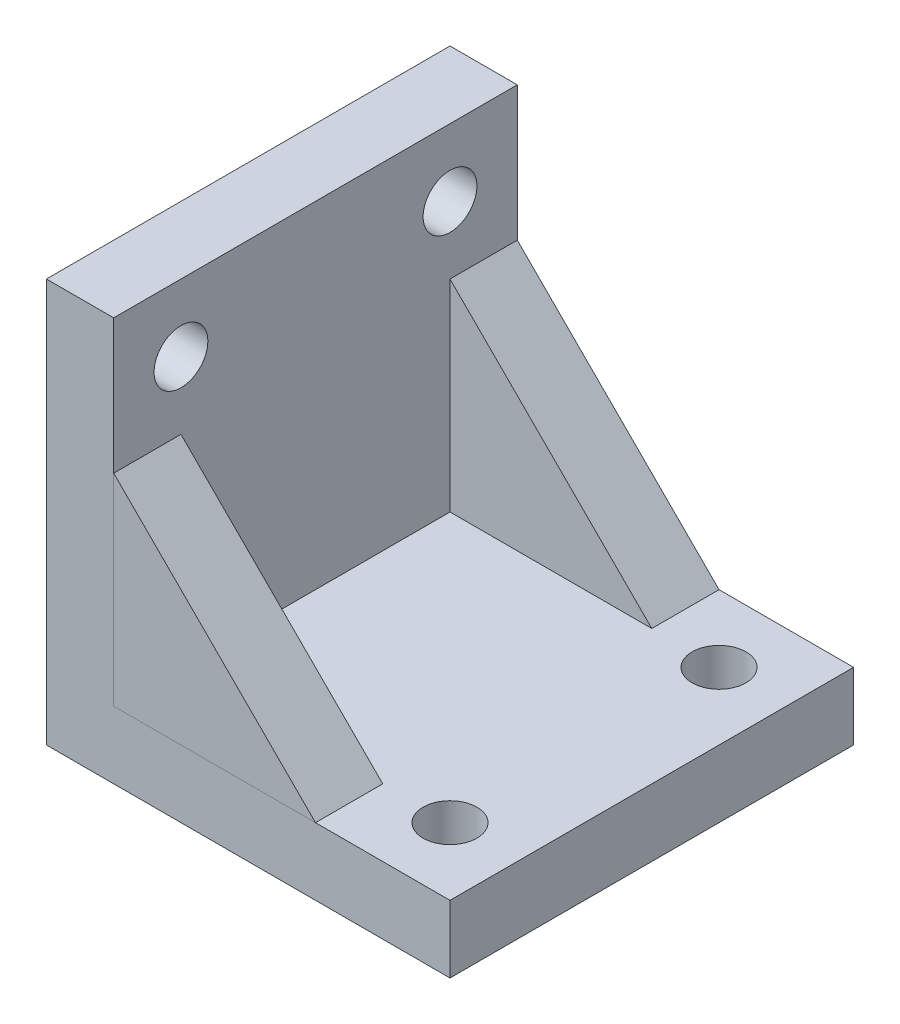
ISO-10303-21;
HEADER;
FILE_DESCRIPTION(('STEP AP214'),'2;1');
FILE_NAME('part.step','',(''),(''),'','','');
FILE_SCHEMA(('AUTOMOTIVE_DESIGN { 1 0 10303 214 1 1 1 1 }'));
ENDSEC;
DATA;
#1=APPLICATION_CONTEXT('core data for automotive mechanical design processes');
#2=APPLICATION_PROTOCOL_DEFINITION('international standard','automotive_design',2000,#1);
#3=PRODUCT_CONTEXT('',#1,'mechanical');
#4=PRODUCT('Part','Part','',(#3));
#5=PRODUCT_RELATED_PRODUCT_CATEGORY('part','',(#4));
#6=PRODUCT_DEFINITION_FORMATION('','',#4);
#7=PRODUCT_DEFINITION_CONTEXT('part definition',#1,'design');
#8=PRODUCT_DEFINITION('design','',#6,#7);
#9=PRODUCT_DEFINITION_SHAPE('','',#8);
#10=(LENGTH_UNIT() NAMED_UNIT(*) SI_UNIT(.MILLI.,.METRE.));
#11=(NAMED_UNIT(*) PLANE_ANGLE_UNIT() SI_UNIT($,.RADIAN.));
#12=(NAMED_UNIT(*) SI_UNIT($,.STERADIAN.) SOLID_ANGLE_UNIT());
#13=UNCERTAINTY_MEASURE_WITH_UNIT(LENGTH_MEASURE(1.E-05),#10,'distance_accuracy_value','');
#14=(GEOMETRIC_REPRESENTATION_CONTEXT(3) GLOBAL_UNCERTAINTY_ASSIGNED_CONTEXT((#13)) GLOBAL_UNIT_ASSIGNED_CONTEXT((#10,
#11,#12)) REPRESENTATION_CONTEXT('',''));
#15=CARTESIAN_POINT('',(0.,0.,0.));
#16=DIRECTION('',(0.,0.,1.));
#17=DIRECTION('',(1.,0.,0.));
#18=AXIS2_PLACEMENT_3D('',#15,#16,#17);
#19=CARTESIAN_POINT('',(5.00000000000001,5.,10.));
#20=DIRECTION('',(0.,-1.,0.));
#21=DIRECTION('',(0.,0.,-1.));
#22=AXIS2_PLACEMENT_3D('',#19,#20,#21);
#23=PLANE('',#22);
#24=DIRECTION('',(1.,0.,0.));
#25=VECTOR('',#24,1.);
#26=CARTESIAN_POINT('',(5.00000000000001,5.,15.));
#27=LINE('',#26,#25);
#28=CARTESIAN_POINT('',(-9.99999999999999,5.,15.));
#29=VERTEX_POINT('',#28);
#30=CARTESIAN_POINT('',(5.00000000000001,5.,15.));
#31=VERTEX_POINT('',#30);
#32=EDGE_CURVE('E96',#29,#31,#27,.T.);
#33=ORIENTED_EDGE('',*,*,#32,.F.);
#34=DIRECTION('',(0.,0.,1.));
#35=VECTOR('',#34,1.);
#36=CARTESIAN_POINT('',(-9.99999999999999,5.,10.));
#37=LINE('',#36,#35);
#38=CARTESIAN_POINT('',(-9.99999999999999,5.,10.));
#39=VERTEX_POINT('',#38);
#40=EDGE_CURVE('E12',#39,#29,#37,.T.);
#41=ORIENTED_EDGE('',*,*,#40,.F.);
#42=DIRECTION('',(1.,0.,0.));
#43=VECTOR('',#42,1.);
#44=CARTESIAN_POINT('',(5.00000000000001,5.,10.));
#45=LINE('',#44,#43);
#46=CARTESIAN_POINT('',(5.00000000000001,5.,10.));
#47=VERTEX_POINT('',#46);
#48=EDGE_CURVE('E88',#39,#47,#45,.T.);
#49=ORIENTED_EDGE('',*,*,#48,.T.);
#50=DIRECTION('',(0.,0.,1.));
#51=VECTOR('',#50,1.);
#52=CARTESIAN_POINT('',(5.00000000000001,5.,10.));
#53=LINE('',#52,#51);
#54=EDGE_CURVE('E47',#47,#31,#53,.T.);
#55=ORIENTED_EDGE('',*,*,#54,.T.);
#56=EDGE_LOOP('',(#33,#41,#49,#55));
#57=FACE_BOUND('',#56,.T.);
#58=ADVANCED_FACE('F44',(#57),#23,.T.);
#59=CARTESIAN_POINT('',(-9.99999999999999,5.,10.));
#60=DIRECTION('',(-1.,0.,0.));
#61=DIRECTION('',(0.,-1.,0.));
#62=AXIS2_PLACEMENT_3D('',#59,#60,#61);
#63=PLANE('',#62);
#64=DIRECTION('',(0.,-1.,0.));
#65=VECTOR('',#64,1.);
#66=CARTESIAN_POINT('',(-9.99999999999999,5.,15.));
#67=LINE('',#66,#65);
#68=CARTESIAN_POINT('',(-9.99999999999999,20.,15.));
#69=VERTEX_POINT('',#68);
#70=EDGE_CURVE('E90',#69,#29,#67,.T.);
#71=ORIENTED_EDGE('',*,*,#70,.F.);
#72=DIRECTION('',(0.,0.,1.));
#73=VECTOR('',#72,1.);
#74=CARTESIAN_POINT('',(-9.99999999999999,20.,10.));
#75=LINE('',#74,#73);
#76=CARTESIAN_POINT('',(-9.99999999999999,20.,10.));
#77=VERTEX_POINT('',#76);
#78=EDGE_CURVE('E53',#77,#69,#75,.T.);
#79=ORIENTED_EDGE('',*,*,#78,.F.);
#80=DIRECTION('',(0.,-1.,0.));
#81=VECTOR('',#80,1.);
#82=CARTESIAN_POINT('',(-9.99999999999999,5.,10.));
#83=LINE('',#82,#81);
#84=EDGE_CURVE('E85',#77,#39,#83,.T.);
#85=ORIENTED_EDGE('',*,*,#84,.T.);
#86=ORIENTED_EDGE('',*,*,#40,.T.);
#87=EDGE_LOOP('',(#71,#79,#85,#86));
#88=FACE_BOUND('',#87,.T.);
#89=ADVANCED_FACE('F100',(#88),#63,.T.);
#90=CARTESIAN_POINT('',(-9.99999999999999,20.,10.));
#91=DIRECTION('',(0.707106781186548,0.707106781186548,0.));
#92=DIRECTION('',(-0.707106781186548,0.707106781186548,0.));
#93=AXIS2_PLACEMENT_3D('',#90,#91,#92);
#94=PLANE('',#93);
#95=DIRECTION('',(-0.707106781186547,0.707106781186547,0.));
#96=VECTOR('',#95,1.);
#97=CARTESIAN_POINT('',(-9.99999999999999,20.,15.));
#98=LINE('',#97,#96);
#99=EDGE_CURVE('E83',#31,#69,#98,.T.);
#100=ORIENTED_EDGE('',*,*,#99,.F.);
#101=ORIENTED_EDGE('',*,*,#54,.F.);
#102=DIRECTION('',(-0.707106781186547,0.707106781186547,0.));
#103=VECTOR('',#102,1.);
#104=CARTESIAN_POINT('',(-9.99999999999999,20.,10.));
#105=LINE('',#104,#103);
#106=EDGE_CURVE('E81',#47,#77,#105,.T.);
#107=ORIENTED_EDGE('',*,*,#106,.T.);
#108=ORIENTED_EDGE('',*,*,#78,.T.);
#109=EDGE_LOOP('',(#100,#101,#107,#108));
#110=FACE_BOUND('',#109,.T.);
#111=ADVANCED_FACE('F80',(#110),#94,.T.);
#112=CARTESIAN_POINT('',(0.,0.,10.));
#113=DIRECTION('',(0.,0.,-1.));
#114=DIRECTION('',(-1.,0.,0.));
#115=AXIS2_PLACEMENT_3D('',#112,#113,#114);
#116=PLANE('',#115);
#117=ORIENTED_EDGE('',*,*,#48,.F.);
#118=ORIENTED_EDGE('',*,*,#84,.F.);
#119=ORIENTED_EDGE('',*,*,#106,.F.);
#120=EDGE_LOOP('',(#117,#118,#119));
#121=FACE_BOUND('',#120,.T.);
#122=ADVANCED_FACE('F87',(#121),#116,.T.);
#123=CARTESIAN_POINT('',(0.,0.,15.));
#124=DIRECTION('',(0.,0.,-1.));
#125=DIRECTION('',(-1.,0.,0.));
#126=AXIS2_PLACEMENT_3D('',#123,#124,#125);
#127=PLANE('',#126);
#128=ORIENTED_EDGE('',*,*,#32,.T.);
#129=ORIENTED_EDGE('',*,*,#99,.T.);
#130=ORIENTED_EDGE('',*,*,#70,.T.);
#131=EDGE_LOOP('',(#128,#129,#130));
#132=FACE_BOUND('',#131,.T.);
#133=ADVANCED_FACE('F99',(#132),#127,.F.);
#134=CLOSED_SHELL('',(#58,#89,#111,#122,#133));
#135=MANIFOLD_SOLID_BREP('B2',#134);
#136=CARTESIAN_POINT('',(0.,5.,0.));
#137=DIRECTION('',(0.,-1.,0.));
#138=DIRECTION('',(0.,0.,-1.));
#139=AXIS2_PLACEMENT_3D('',#136,#137,#138);
#140=PLANE('',#139);
#141=CARTESIAN_POINT('',(10.,5.,10.));
#142=DIRECTION('',(0.,1.,0.));
#143=DIRECTION('',(0.,0.,1.));
#144=AXIS2_PLACEMENT_3D('',#141,#142,#143);
#145=CIRCLE('',#144,2.);
#146=CARTESIAN_POINT('',(10.,5.,12.));
#147=VERTEX_POINT('',#146);
#148=EDGE_CURVE('E308',#147,#147,#145,.T.);
#149=ORIENTED_EDGE('',*,*,#148,.F.);
#150=EDGE_LOOP('',(#149));
#151=FACE_BOUND('',#150,.T.);
#152=CARTESIAN_POINT('',(10.,5.,-10.));
#153=DIRECTION('',(0.,1.,0.));
#154=DIRECTION('',(0.,0.,1.));
#155=AXIS2_PLACEMENT_3D('',#152,#153,#154);
#156=CIRCLE('',#155,2.);
#157=CARTESIAN_POINT('',(10.,5.,-8.));
#158=VERTEX_POINT('',#157);
#159=EDGE_CURVE('E302',#158,#158,#156,.T.);
#160=ORIENTED_EDGE('',*,*,#159,.F.);
#161=EDGE_LOOP('',(#160));
#162=FACE_BOUND('',#161,.T.);
#163=DIRECTION('',(0.,0.,-1.));
#164=VECTOR('',#163,1.);
#165=CARTESIAN_POINT('',(5.00000000000001,5.,-10.));
#166=LINE('',#165,#164);
#167=CARTESIAN_POINT('',(5.00000000000001,5.,-10.));
#168=VERTEX_POINT('',#167);
#169=CARTESIAN_POINT('',(5.00000000000001,5.,-15.));
#170=VERTEX_POINT('',#169);
#171=EDGE_CURVE('E241',#168,#170,#166,.T.);
#172=ORIENTED_EDGE('',*,*,#171,.F.);
#173=DIRECTION('',(1.,0.,0.));
#174=VECTOR('',#173,1.);
#175=CARTESIAN_POINT('',(5.00000000000001,5.,-10.));
#176=LINE('',#175,#174);
#177=CARTESIAN_POINT('',(-9.99999999999999,5.,-10.));
#178=VERTEX_POINT('',#177);
#179=EDGE_CURVE('E256',#178,#168,#176,.T.);
#180=ORIENTED_EDGE('',*,*,#179,.F.);
#181=DIRECTION('',(0.,0.,-1.));
#182=VECTOR('',#181,1.);
#183=CARTESIAN_POINT('',(-9.99999999999999,5.,-15.));
#184=LINE('',#183,#182);
#185=CARTESIAN_POINT('',(-9.99999999999999,5.,15.));
#186=VERTEX_POINT('',#185);
#187=EDGE_CURVE('E156',#186,#178,#184,.T.);
#188=ORIENTED_EDGE('',*,*,#187,.F.);
#189=DIRECTION('',(1.,0.,0.));
#190=VECTOR('',#189,1.);
#191=CARTESIAN_POINT('',(-15.,5.,15.));
#192=LINE('',#191,#190);
#193=CARTESIAN_POINT('',(15.,5.,15.));
#194=VERTEX_POINT('',#193);
#195=EDGE_CURVE('E161',#186,#194,#192,.T.);
#196=ORIENTED_EDGE('',*,*,#195,.T.);
#197=DIRECTION('',(0.,0.,-1.));
#198=VECTOR('',#197,1.);
#199=CARTESIAN_POINT('',(15.,5.,15.));
#200=LINE('',#199,#198);
#201=CARTESIAN_POINT('',(15.,5.,-15.));
#202=VERTEX_POINT('',#201);
#203=EDGE_CURVE('E192',#194,#202,#200,.T.);
#204=ORIENTED_EDGE('',*,*,#203,.T.);
#205=DIRECTION('',(-1.,0.,0.));
#206=VECTOR('',#205,1.);
#207=CARTESIAN_POINT('',(-15.,5.,-15.));
#208=LINE('',#207,#206);
#209=EDGE_CURVE('E243',#202,#170,#208,.T.);
#210=ORIENTED_EDGE('',*,*,#209,.T.);
#211=EDGE_LOOP('',(#172,#180,#188,#196,#204,#210));
#212=FACE_BOUND('',#211,.T.);
#213=ADVANCED_FACE('F141',(#151,#162,#212),#140,.F.);
#214=CARTESIAN_POINT('',(-9.99999999999999,30.,-15.));
#215=DIRECTION('',(-1.,0.,0.));
#216=DIRECTION('',(0.,0.,1.));
#217=AXIS2_PLACEMENT_3D('',#214,#215,#216);
#218=PLANE('',#217);
#219=CARTESIAN_POINT('',(-9.99999999999999,25.,-10.));
#220=DIRECTION('',(1.,0.,0.));
#221=DIRECTION('',(0.,0.,-1.));
#222=AXIS2_PLACEMENT_3D('',#219,#220,#221);
#223=CIRCLE('',#222,2.);
#224=CARTESIAN_POINT('',(-9.99999999999999,25.,-12.));
#225=VERTEX_POINT('',#224);
#226=EDGE_CURVE('E296',#225,#225,#223,.T.);
#227=ORIENTED_EDGE('',*,*,#226,.F.);
#228=EDGE_LOOP('',(#227));
#229=FACE_BOUND('',#228,.T.);
#230=CARTESIAN_POINT('',(-9.99999999999999,25.,10.));
#231=DIRECTION('',(1.,0.,0.));
#232=DIRECTION('',(0.,0.,-1.));
#233=AXIS2_PLACEMENT_3D('',#230,#231,#232);
#234=CIRCLE('',#233,2.);
#235=CARTESIAN_POINT('',(-9.99999999999999,25.,8.));
#236=VERTEX_POINT('',#235);
#237=EDGE_CURVE('E290',#236,#236,#234,.T.);
#238=ORIENTED_EDGE('',*,*,#237,.F.);
#239=EDGE_LOOP('',(#238));
#240=FACE_BOUND('',#239,.T.);
#241=DIRECTION('',(0.,0.,-1.));
#242=VECTOR('',#241,1.);
#243=CARTESIAN_POINT('',(-9.99999999999999,20.,-10.));
#244=LINE('',#243,#242);
#245=CARTESIAN_POINT('',(-9.99999999999999,20.,-10.));
#246=VERTEX_POINT('',#245);
#247=CARTESIAN_POINT('',(-9.99999999999999,20.,-15.));
#248=VERTEX_POINT('',#247);
#249=EDGE_CURVE('E264',#246,#248,#244,.T.);
#250=ORIENTED_EDGE('',*,*,#249,.T.);
#251=DIRECTION('',(0.,-1.,0.));
#252=VECTOR('',#251,1.);
#253=CARTESIAN_POINT('',(-9.99999999999999,30.,-15.));
#254=LINE('',#253,#252);
#255=CARTESIAN_POINT('',(-9.99999999999999,30.,-15.));
#256=VERTEX_POINT('',#255);
#257=EDGE_CURVE('E206',#256,#248,#254,.T.);
#258=ORIENTED_EDGE('',*,*,#257,.F.);
#259=DIRECTION('',(0.,0.,-1.));
#260=VECTOR('',#259,1.);
#261=CARTESIAN_POINT('',(-9.99999999999999,30.,-15.));
#262=LINE('',#261,#260);
#263=CARTESIAN_POINT('',(-9.99999999999999,30.,15.));
#264=VERTEX_POINT('',#263);
#265=EDGE_CURVE('E233',#264,#256,#262,.T.);
#266=ORIENTED_EDGE('',*,*,#265,.F.);
#267=DIRECTION('',(0.,-1.,0.));
#268=VECTOR('',#267,1.);
#269=CARTESIAN_POINT('',(-9.99999999999999,30.,15.));
#270=LINE('',#269,#268);
#271=EDGE_CURVE('E202',#264,#186,#270,.T.);
#272=ORIENTED_EDGE('',*,*,#271,.T.);
#273=ORIENTED_EDGE('',*,*,#187,.T.);
#274=DIRECTION('',(0.,-1.,0.));
#275=VECTOR('',#274,1.);
#276=CARTESIAN_POINT('',(-9.99999999999999,5.,-10.));
#277=LINE('',#276,#275);
#278=EDGE_CURVE('E266',#246,#178,#277,.T.);
#279=ORIENTED_EDGE('',*,*,#278,.F.);
#280=EDGE_LOOP('',(#250,#258,#266,#272,#273,#279));
#281=FACE_BOUND('',#280,.T.);
#282=ADVANCED_FACE('F273',(#229,#240,#281),#218,.F.);
#283=CARTESIAN_POINT('',(15.,5.,15.));
#284=DIRECTION('',(-1.,0.,0.));
#285=DIRECTION('',(0.,0.,1.));
#286=AXIS2_PLACEMENT_3D('',#283,#284,#285);
#287=PLANE('',#286);
#288=DIRECTION('',(0.,0.,-1.));
#289=VECTOR('',#288,1.);
#290=CARTESIAN_POINT('',(15.,0.,15.));
#291=LINE('',#290,#289);
#292=CARTESIAN_POINT('',(15.,0.,15.));
#293=VERTEX_POINT('',#292);
#294=CARTESIAN_POINT('',(15.,0.,-15.));
#295=VERTEX_POINT('',#294);
#296=EDGE_CURVE('E198',#293,#295,#291,.T.);
#297=ORIENTED_EDGE('',*,*,#296,.T.);
#298=DIRECTION('',(0.,-1.,0.));
#299=VECTOR('',#298,1.);
#300=CARTESIAN_POINT('',(15.,5.,-15.));
#301=LINE('',#300,#299);
#302=EDGE_CURVE('E42',#202,#295,#301,.T.);
#303=ORIENTED_EDGE('',*,*,#302,.F.);
#304=ORIENTED_EDGE('',*,*,#203,.F.);
#305=DIRECTION('',(0.,-1.,0.));
#306=VECTOR('',#305,1.);
#307=CARTESIAN_POINT('',(15.,5.,15.));
#308=LINE('',#307,#306);
#309=EDGE_CURVE('E184',#194,#293,#308,.T.);
#310=ORIENTED_EDGE('',*,*,#309,.T.);
#311=EDGE_LOOP('',(#297,#303,#304,#310));
#312=FACE_BOUND('',#311,.T.);
#313=ADVANCED_FACE('F143',(#312),#287,.F.);
#314=CARTESIAN_POINT('',(-15.,5.,-15.));
#315=DIRECTION('',(0.,0.,1.));
#316=DIRECTION('',(1.,0.,0.));
#317=AXIS2_PLACEMENT_3D('',#314,#315,#316);
#318=PLANE('',#317);
#319=DIRECTION('',(-0.707106781186547,0.707106781186547,0.));
#320=VECTOR('',#319,1.);
#321=CARTESIAN_POINT('',(-9.99999999999999,20.,-15.));
#322=LINE('',#321,#320);
#323=EDGE_CURVE('E252',#170,#248,#322,.T.);
#324=ORIENTED_EDGE('',*,*,#323,.F.);
#325=ORIENTED_EDGE('',*,*,#209,.F.);
#326=ORIENTED_EDGE('',*,*,#302,.T.);
#327=DIRECTION('',(-1.,0.,0.));
#328=VECTOR('',#327,1.);
#329=CARTESIAN_POINT('',(-15.,0.,-15.));
#330=LINE('',#329,#328);
#331=CARTESIAN_POINT('',(-15.,0.,-15.));
#332=VERTEX_POINT('',#331);
#333=EDGE_CURVE('E201',#295,#332,#330,.T.);
#334=ORIENTED_EDGE('',*,*,#333,.T.);
#335=DIRECTION('',(0.,-1.,0.));
#336=VECTOR('',#335,1.);
#337=CARTESIAN_POINT('',(-15.,5.,-15.));
#338=LINE('',#337,#336);
#339=CARTESIAN_POINT('',(-15.,30.,-15.));
#340=VERTEX_POINT('',#339);
#341=EDGE_CURVE('E149',#340,#332,#338,.T.);
#342=ORIENTED_EDGE('',*,*,#341,.F.);
#343=DIRECTION('',(-1.,0.,0.));
#344=VECTOR('',#343,1.);
#345=CARTESIAN_POINT('',(-15.,30.,-15.));
#346=LINE('',#345,#344);
#347=EDGE_CURVE('E226',#256,#340,#346,.T.);
#348=ORIENTED_EDGE('',*,*,#347,.F.);
#349=ORIENTED_EDGE('',*,*,#257,.T.);
#350=EDGE_LOOP('',(#324,#325,#326,#334,#342,#348,#349));
#351=FACE_BOUND('',#350,.T.);
#352=ADVANCED_FACE('F223',(#351),#318,.F.);
#353=CARTESIAN_POINT('',(-15.,5.,15.));
#354=DIRECTION('',(1.,0.,0.));
#355=DIRECTION('',(0.,0.,-1.));
#356=AXIS2_PLACEMENT_3D('',#353,#354,#355);
#357=PLANE('',#356);
#358=CARTESIAN_POINT('',(-15.,25.,-10.));
#359=DIRECTION('',(1.,0.,0.));
#360=DIRECTION('',(0.,0.,-1.));
#361=AXIS2_PLACEMENT_3D('',#358,#359,#360);
#362=CIRCLE('',#361,2.);
#363=CARTESIAN_POINT('',(-15.,25.,-12.));
#364=VERTEX_POINT('',#363);
#365=EDGE_CURVE('E293',#364,#364,#362,.T.);
#366=ORIENTED_EDGE('',*,*,#365,.T.);
#367=EDGE_LOOP('',(#366));
#368=FACE_BOUND('',#367,.T.);
#369=CARTESIAN_POINT('',(-15.,25.,10.));
#370=DIRECTION('',(1.,0.,0.));
#371=DIRECTION('',(0.,0.,-1.));
#372=AXIS2_PLACEMENT_3D('',#369,#370,#371);
#373=CIRCLE('',#372,2.);
#374=CARTESIAN_POINT('',(-15.,25.,8.));
#375=VERTEX_POINT('',#374);
#376=EDGE_CURVE('E257',#375,#375,#373,.T.);
#377=ORIENTED_EDGE('',*,*,#376,.T.);
#378=EDGE_LOOP('',(#377));
#379=FACE_BOUND('',#378,.T.);
#380=DIRECTION('',(0.,0.,1.));
#381=VECTOR('',#380,1.);
#382=CARTESIAN_POINT('',(-15.,0.,15.));
#383=LINE('',#382,#381);
#384=CARTESIAN_POINT('',(-15.,0.,15.));
#385=VERTEX_POINT('',#384);
#386=EDGE_CURVE('E193',#332,#385,#383,.T.);
#387=ORIENTED_EDGE('',*,*,#386,.T.);
#388=DIRECTION('',(0.,-1.,0.));
#389=VECTOR('',#388,1.);
#390=CARTESIAN_POINT('',(-15.,5.,15.));
#391=LINE('',#390,#389);
#392=CARTESIAN_POINT('',(-15.,30.,15.));
#393=VERTEX_POINT('',#392);
#394=EDGE_CURVE('E188',#393,#385,#391,.T.);
#395=ORIENTED_EDGE('',*,*,#394,.F.);
#396=DIRECTION('',(0.,0.,1.));
#397=VECTOR('',#396,1.);
#398=CARTESIAN_POINT('',(-15.,30.,-15.));
#399=LINE('',#398,#397);
#400=EDGE_CURVE('E218',#340,#393,#399,.T.);
#401=ORIENTED_EDGE('',*,*,#400,.F.);
#402=ORIENTED_EDGE('',*,*,#341,.T.);
#403=EDGE_LOOP('',(#387,#395,#401,#402));
#404=FACE_BOUND('',#403,.T.);
#405=ADVANCED_FACE('F216',(#368,#379,#404),#357,.F.);
#406=CARTESIAN_POINT('',(-15.,5.,15.));
#407=DIRECTION('',(0.,0.,-1.));
#408=DIRECTION('',(-1.,0.,0.));
#409=AXIS2_PLACEMENT_3D('',#406,#407,#408);
#410=PLANE('',#409);
#411=DIRECTION('',(1.,0.,0.));
#412=VECTOR('',#411,1.);
#413=CARTESIAN_POINT('',(-15.,0.,15.));
#414=LINE('',#413,#412);
#415=EDGE_CURVE('E181',#385,#293,#414,.T.);
#416=ORIENTED_EDGE('',*,*,#415,.T.);
#417=ORIENTED_EDGE('',*,*,#309,.F.);
#418=ORIENTED_EDGE('',*,*,#195,.F.);
#419=ORIENTED_EDGE('',*,*,#271,.F.);
#420=DIRECTION('',(1.,0.,0.));
#421=VECTOR('',#420,1.);
#422=CARTESIAN_POINT('',(-15.,30.,15.));
#423=LINE('',#422,#421);
#424=EDGE_CURVE('E237',#393,#264,#423,.T.);
#425=ORIENTED_EDGE('',*,*,#424,.F.);
#426=ORIENTED_EDGE('',*,*,#394,.T.);
#427=EDGE_LOOP('',(#416,#417,#418,#419,#425,#426));
#428=FACE_BOUND('',#427,.T.);
#429=ADVANCED_FACE('F183',(#428),#410,.F.);
#430=CARTESIAN_POINT('',(0.,0.,0.));
#431=DIRECTION('',(0.,-1.,0.));
#432=DIRECTION('',(0.,0.,-1.));
#433=AXIS2_PLACEMENT_3D('',#430,#431,#432);
#434=PLANE('',#433);
#435=CARTESIAN_POINT('',(10.,0.,10.));
#436=DIRECTION('',(0.,1.,0.));
#437=DIRECTION('',(0.,0.,1.));
#438=AXIS2_PLACEMENT_3D('',#435,#436,#437);
#439=CIRCLE('',#438,2.);
#440=CARTESIAN_POINT('',(10.,0.,12.));
#441=VERTEX_POINT('',#440);
#442=EDGE_CURVE('E305',#441,#441,#439,.T.);
#443=ORIENTED_EDGE('',*,*,#442,.T.);
#444=EDGE_LOOP('',(#443));
#445=FACE_BOUND('',#444,.T.);
#446=CARTESIAN_POINT('',(10.,0.,-10.));
#447=DIRECTION('',(0.,1.,0.));
#448=DIRECTION('',(0.,0.,1.));
#449=AXIS2_PLACEMENT_3D('',#446,#447,#448);
#450=CIRCLE('',#449,2.);
#451=CARTESIAN_POINT('',(10.,0.,-8.));
#452=VERTEX_POINT('',#451);
#453=EDGE_CURVE('E299',#452,#452,#450,.T.);
#454=ORIENTED_EDGE('',*,*,#453,.T.);
#455=EDGE_LOOP('',(#454));
#456=FACE_BOUND('',#455,.T.);
#457=ORIENTED_EDGE('',*,*,#296,.F.);
#458=ORIENTED_EDGE('',*,*,#415,.F.);
#459=ORIENTED_EDGE('',*,*,#386,.F.);
#460=ORIENTED_EDGE('',*,*,#333,.F.);
#461=EDGE_LOOP('',(#457,#458,#459,#460));
#462=FACE_BOUND('',#461,.T.);
#463=ADVANCED_FACE('F200',(#445,#456,#462),#434,.T.);
#464=CARTESIAN_POINT('',(0.,30.,0.));
#465=DIRECTION('',(0.,1.,0.));
#466=DIRECTION('',(0.,0.,1.));
#467=AXIS2_PLACEMENT_3D('',#464,#465,#466);
#468=PLANE('',#467);
#469=ORIENTED_EDGE('',*,*,#400,.T.);
#470=ORIENTED_EDGE('',*,*,#424,.T.);
#471=ORIENTED_EDGE('',*,*,#265,.T.);
#472=ORIENTED_EDGE('',*,*,#347,.T.);
#473=EDGE_LOOP('',(#469,#470,#471,#472));
#474=FACE_BOUND('',#473,.T.);
#475=ADVANCED_FACE('F229',(#474),#468,.T.);
#476=CARTESIAN_POINT('',(-9.99999999999999,20.,-10.));
#477=DIRECTION('',(-0.707106781186548,-0.707106781186548,0.));
#478=DIRECTION('',(0.707106781186548,-0.707106781186548,0.));
#479=AXIS2_PLACEMENT_3D('',#476,#477,#478);
#480=PLANE('',#479);
#481=ORIENTED_EDGE('',*,*,#323,.T.);
#482=ORIENTED_EDGE('',*,*,#249,.F.);
#483=DIRECTION('',(-0.707106781186547,0.707106781186547,0.));
#484=VECTOR('',#483,1.);
#485=CARTESIAN_POINT('',(-9.99999999999999,20.,-10.));
#486=LINE('',#485,#484);
#487=EDGE_CURVE('E262',#168,#246,#486,.T.);
#488=ORIENTED_EDGE('',*,*,#487,.F.);
#489=ORIENTED_EDGE('',*,*,#171,.T.);
#490=EDGE_LOOP('',(#481,#482,#488,#489));
#491=FACE_BOUND('',#490,.T.);
#492=ADVANCED_FACE('F260',(#491),#480,.F.);
#493=CARTESIAN_POINT('',(0.,0.,-10.));
#494=DIRECTION('',(0.,0.,-1.));
#495=DIRECTION('',(-1.,0.,0.));
#496=AXIS2_PLACEMENT_3D('',#493,#494,#495);
#497=PLANE('',#496);
#498=ORIENTED_EDGE('',*,*,#179,.T.);
#499=ORIENTED_EDGE('',*,*,#487,.T.);
#500=ORIENTED_EDGE('',*,*,#278,.T.);
#501=EDGE_LOOP('',(#498,#499,#500));
#502=FACE_BOUND('',#501,.T.);
#503=ADVANCED_FACE('F285',(#502),#497,.F.);
#504=CARTESIAN_POINT('',(-15.,25.,10.));
#505=DIRECTION('',(1.,0.,0.));
#506=DIRECTION('',(0.,0.,-1.));
#507=AXIS2_PLACEMENT_3D('',#504,#505,#506);
#508=CYLINDRICAL_SURFACE('',#507,2.);
#509=ORIENTED_EDGE('',*,*,#376,.F.);
#510=EDGE_LOOP('',(#509));
#511=FACE_BOUND('',#510,.T.);
#512=ORIENTED_EDGE('',*,*,#237,.T.);
#513=EDGE_LOOP('',(#512));
#514=FACE_BOUND('',#513,.T.);
#515=ADVANCED_FACE('F335',(#511,#514),#508,.F.);
#516=CARTESIAN_POINT('',(-15.,25.,-10.));
#517=DIRECTION('',(1.,0.,0.));
#518=DIRECTION('',(0.,0.,-1.));
#519=AXIS2_PLACEMENT_3D('',#516,#517,#518);
#520=CYLINDRICAL_SURFACE('',#519,2.);
#521=ORIENTED_EDGE('',*,*,#365,.F.);
#522=EDGE_LOOP('',(#521));
#523=FACE_BOUND('',#522,.T.);
#524=ORIENTED_EDGE('',*,*,#226,.T.);
#525=EDGE_LOOP('',(#524));
#526=FACE_BOUND('',#525,.T.);
#527=ADVANCED_FACE('F329',(#523,#526),#520,.F.);
#528=CARTESIAN_POINT('',(10.,0.,-10.));
#529=DIRECTION('',(0.,1.,0.));
#530=DIRECTION('',(0.,0.,1.));
#531=AXIS2_PLACEMENT_3D('',#528,#529,#530);
#532=CYLINDRICAL_SURFACE('',#531,2.);
#533=ORIENTED_EDGE('',*,*,#453,.F.);
#534=EDGE_LOOP('',(#533));
#535=FACE_BOUND('',#534,.T.);
#536=ORIENTED_EDGE('',*,*,#159,.T.);
#537=EDGE_LOOP('',(#536));
#538=FACE_BOUND('',#537,.T.);
#539=ADVANCED_FACE('F319',(#535,#538),#532,.F.);
#540=CARTESIAN_POINT('',(10.,0.,10.));
#541=DIRECTION('',(0.,1.,0.));
#542=DIRECTION('',(0.,0.,1.));
#543=AXIS2_PLACEMENT_3D('',#540,#541,#542);
#544=CYLINDRICAL_SURFACE('',#543,2.);
#545=ORIENTED_EDGE('',*,*,#442,.F.);
#546=EDGE_LOOP('',(#545));
#547=FACE_BOUND('',#546,.T.);
#548=ORIENTED_EDGE('',*,*,#148,.T.);
#549=EDGE_LOOP('',(#548));
#550=FACE_BOUND('',#549,.T.);
#551=ADVANCED_FACE('F316',(#547,#550),#544,.F.);
#552=CLOSED_SHELL('',(#213,#282,#313,#352,#405,#429,#463,#475,#492,#503,#515,#527,#539,#551));
#553=MANIFOLD_SOLID_BREP('B6',#552);
#554=ADVANCED_BREP_SHAPE_REPRESENTATION('',(#18,#135,#553),#14);
#555=SHAPE_DEFINITION_REPRESENTATION(#9,#554);
ENDSEC;
END-ISO-10303-21;
